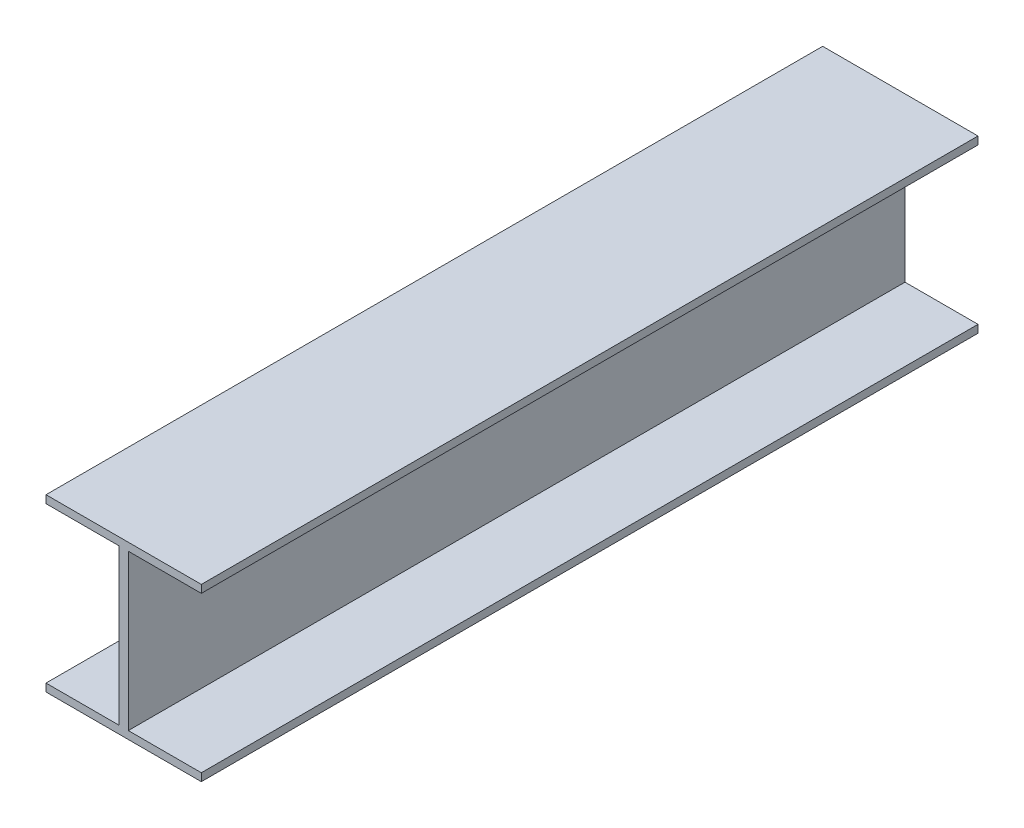
ISO-10303-21;
HEADER;
FILE_DESCRIPTION(('STEP AP214'),'2;1');
FILE_NAME('part.step','',(''),(''),'','','');
FILE_SCHEMA(('AUTOMOTIVE_DESIGN { 1 0 10303 214 1 1 1 1 }'));
ENDSEC;
DATA;
#1=APPLICATION_CONTEXT('core data for automotive mechanical design processes');
#2=APPLICATION_PROTOCOL_DEFINITION('international standard','automotive_design',2000,#1);
#3=PRODUCT_CONTEXT('',#1,'mechanical');
#4=PRODUCT('Part','Part','',(#3));
#5=PRODUCT_RELATED_PRODUCT_CATEGORY('part','',(#4));
#6=PRODUCT_DEFINITION_FORMATION('','',#4);
#7=PRODUCT_DEFINITION_CONTEXT('part definition',#1,'design');
#8=PRODUCT_DEFINITION('design','',#6,#7);
#9=PRODUCT_DEFINITION_SHAPE('','',#8);
#10=(LENGTH_UNIT() NAMED_UNIT(*) SI_UNIT(.MILLI.,.METRE.));
#11=(NAMED_UNIT(*) PLANE_ANGLE_UNIT() SI_UNIT($,.RADIAN.));
#12=(NAMED_UNIT(*) SI_UNIT($,.STERADIAN.) SOLID_ANGLE_UNIT());
#13=UNCERTAINTY_MEASURE_WITH_UNIT(LENGTH_MEASURE(1.E-05),#10,'distance_accuracy_value','');
#14=(GEOMETRIC_REPRESENTATION_CONTEXT(3) GLOBAL_UNCERTAINTY_ASSIGNED_CONTEXT((#13)) GLOBAL_UNIT_ASSIGNED_CONTEXT((#10,
#11,#12)) REPRESENTATION_CONTEXT('',''));
#15=CARTESIAN_POINT('',(0.,0.,0.));
#16=DIRECTION('',(0.,0.,1.));
#17=DIRECTION('',(1.,0.,0.));
#18=AXIS2_PLACEMENT_3D('',#15,#16,#17);
#19=CARTESIAN_POINT('',(-50.,-50.,500.));
#20=DIRECTION('',(0.,-1.,0.));
#21=DIRECTION('',(0.,0.,-1.));
#22=AXIS2_PLACEMENT_3D('',#19,#20,#21);
#23=PLANE('',#22);
#24=DIRECTION('',(-1.,0.,0.));
#25=VECTOR('',#24,1.);
#26=CARTESIAN_POINT('',(-50.,-50.,0.));
#27=LINE('',#26,#25);
#28=CARTESIAN_POINT('',(-3.,-50.,0.));
#29=VERTEX_POINT('',#28);
#30=CARTESIAN_POINT('',(-50.,-50.,0.));
#31=VERTEX_POINT('',#30);
#32=EDGE_CURVE('E158',#29,#31,#27,.T.);
#33=ORIENTED_EDGE('',*,*,#32,.T.);
#34=DIRECTION('',(0.,0.,-1.));
#35=VECTOR('',#34,1.);
#36=CARTESIAN_POINT('',(-50.,-50.,500.));
#37=LINE('',#36,#35);
#38=CARTESIAN_POINT('',(-50.,-50.,500.));
#39=VERTEX_POINT('',#38);
#40=EDGE_CURVE('E11',#39,#31,#37,.T.);
#41=ORIENTED_EDGE('',*,*,#40,.F.);
#42=DIRECTION('',(-1.,0.,0.));
#43=VECTOR('',#42,1.);
#44=CARTESIAN_POINT('',(-50.,-50.,500.));
#45=LINE('',#44,#43);
#46=CARTESIAN_POINT('',(-3.,-50.,500.));
#47=VERTEX_POINT('',#46);
#48=EDGE_CURVE('E180',#47,#39,#45,.T.);
#49=ORIENTED_EDGE('',*,*,#48,.F.);
#50=DIRECTION('',(0.,0.,-1.));
#51=VECTOR('',#50,1.);
#52=CARTESIAN_POINT('',(-3.,-50.,500.));
#53=LINE('',#52,#51);
#54=EDGE_CURVE('E154',#47,#29,#53,.T.);
#55=ORIENTED_EDGE('',*,*,#54,.T.);
#56=EDGE_LOOP('',(#33,#41,#49,#55));
#57=FACE_BOUND('',#56,.T.);
#58=ADVANCED_FACE('F38',(#57),#23,.F.);
#59=CARTESIAN_POINT('',(-50.,-50.,500.));
#60=DIRECTION('',(1.,0.,0.));
#61=DIRECTION('',(0.,0.,-1.));
#62=AXIS2_PLACEMENT_3D('',#59,#60,#61);
#63=PLANE('',#62);
#64=DIRECTION('',(0.,-1.,0.));
#65=VECTOR('',#64,1.);
#66=CARTESIAN_POINT('',(-50.,-50.,0.));
#67=LINE('',#66,#65);
#68=CARTESIAN_POINT('',(-50.,-55.,0.));
#69=VERTEX_POINT('',#68);
#70=EDGE_CURVE('E161',#31,#69,#67,.T.);
#71=ORIENTED_EDGE('',*,*,#70,.T.);
#72=DIRECTION('',(0.,0.,-1.));
#73=VECTOR('',#72,1.);
#74=CARTESIAN_POINT('',(-50.,-55.,500.));
#75=LINE('',#74,#73);
#76=CARTESIAN_POINT('',(-50.,-55.,500.));
#77=VERTEX_POINT('',#76);
#78=EDGE_CURVE('E46',#77,#69,#75,.T.);
#79=ORIENTED_EDGE('',*,*,#78,.F.);
#80=DIRECTION('',(0.,-1.,0.));
#81=VECTOR('',#80,1.);
#82=CARTESIAN_POINT('',(-50.,-50.,500.));
#83=LINE('',#82,#81);
#84=EDGE_CURVE('E109',#39,#77,#83,.T.);
#85=ORIENTED_EDGE('',*,*,#84,.F.);
#86=ORIENTED_EDGE('',*,*,#40,.T.);
#87=EDGE_LOOP('',(#71,#79,#85,#86));
#88=FACE_BOUND('',#87,.T.);
#89=ADVANCED_FACE('F258',(#88),#63,.F.);
#90=CARTESIAN_POINT('',(-50.,-55.,500.));
#91=DIRECTION('',(0.,1.,0.));
#92=DIRECTION('',(-1.,0.,0.));
#93=AXIS2_PLACEMENT_3D('',#90,#91,#92);
#94=PLANE('',#93);
#95=DIRECTION('',(1.,0.,0.));
#96=VECTOR('',#95,1.);
#97=CARTESIAN_POINT('',(-50.,-55.,0.));
#98=LINE('',#97,#96);
#99=CARTESIAN_POINT('',(50.,-55.,0.));
#100=VERTEX_POINT('',#99);
#101=EDGE_CURVE('E163',#69,#100,#98,.T.);
#102=ORIENTED_EDGE('',*,*,#101,.T.);
#103=DIRECTION('',(0.,0.,-1.));
#104=VECTOR('',#103,1.);
#105=CARTESIAN_POINT('',(50.,-55.,500.));
#106=LINE('',#105,#104);
#107=CARTESIAN_POINT('',(50.,-55.,500.));
#108=VERTEX_POINT('',#107);
#109=EDGE_CURVE('E199',#108,#100,#106,.T.);
#110=ORIENTED_EDGE('',*,*,#109,.F.);
#111=DIRECTION('',(1.,0.,0.));
#112=VECTOR('',#111,1.);
#113=CARTESIAN_POINT('',(-50.,-55.,500.));
#114=LINE('',#113,#112);
#115=EDGE_CURVE('E207',#77,#108,#114,.T.);
#116=ORIENTED_EDGE('',*,*,#115,.F.);
#117=ORIENTED_EDGE('',*,*,#78,.T.);
#118=EDGE_LOOP('',(#102,#110,#116,#117));
#119=FACE_BOUND('',#118,.T.);
#120=ADVANCED_FACE('F205',(#119),#94,.F.);
#121=CARTESIAN_POINT('',(50.,-50.,500.));
#122=DIRECTION('',(-1.,0.,0.));
#123=DIRECTION('',(0.,0.,1.));
#124=AXIS2_PLACEMENT_3D('',#121,#122,#123);
#125=PLANE('',#124);
#126=DIRECTION('',(0.,1.,0.));
#127=VECTOR('',#126,1.);
#128=CARTESIAN_POINT('',(50.,-50.,0.));
#129=LINE('',#128,#127);
#130=CARTESIAN_POINT('',(50.,-50.,0.));
#131=VERTEX_POINT('',#130);
#132=EDGE_CURVE('E165',#100,#131,#129,.T.);
#133=ORIENTED_EDGE('',*,*,#132,.T.);
#134=DIRECTION('',(0.,0.,-1.));
#135=VECTOR('',#134,1.);
#136=CARTESIAN_POINT('',(50.,-50.,500.));
#137=LINE('',#136,#135);
#138=CARTESIAN_POINT('',(50.,-50.,500.));
#139=VERTEX_POINT('',#138);
#140=EDGE_CURVE('E196',#139,#131,#137,.T.);
#141=ORIENTED_EDGE('',*,*,#140,.F.);
#142=DIRECTION('',(0.,1.,0.));
#143=VECTOR('',#142,1.);
#144=CARTESIAN_POINT('',(50.,-50.,500.));
#145=LINE('',#144,#143);
#146=EDGE_CURVE('E225',#108,#139,#145,.T.);
#147=ORIENTED_EDGE('',*,*,#146,.F.);
#148=ORIENTED_EDGE('',*,*,#109,.T.);
#149=EDGE_LOOP('',(#133,#141,#147,#148));
#150=FACE_BOUND('',#149,.T.);
#151=ADVANCED_FACE('F216',(#150),#125,.F.);
#152=CARTESIAN_POINT('',(3.,-50.,500.));
#153=DIRECTION('',(0.,-1.,0.));
#154=DIRECTION('',(0.,0.,-1.));
#155=AXIS2_PLACEMENT_3D('',#152,#153,#154);
#156=PLANE('',#155);
#157=DIRECTION('',(-1.,0.,0.));
#158=VECTOR('',#157,1.);
#159=CARTESIAN_POINT('',(3.,-50.,0.));
#160=LINE('',#159,#158);
#161=CARTESIAN_POINT('',(3.,-50.,0.));
#162=VERTEX_POINT('',#161);
#163=EDGE_CURVE('E167',#131,#162,#160,.T.);
#164=ORIENTED_EDGE('',*,*,#163,.T.);
#165=DIRECTION('',(0.,0.,-1.));
#166=VECTOR('',#165,1.);
#167=CARTESIAN_POINT('',(3.,-50.,500.));
#168=LINE('',#167,#166);
#169=CARTESIAN_POINT('',(3.,-50.,500.));
#170=VERTEX_POINT('',#169);
#171=EDGE_CURVE('E193',#170,#162,#168,.T.);
#172=ORIENTED_EDGE('',*,*,#171,.F.);
#173=DIRECTION('',(-1.,0.,0.));
#174=VECTOR('',#173,1.);
#175=CARTESIAN_POINT('',(3.,-50.,500.));
#176=LINE('',#175,#174);
#177=EDGE_CURVE('E222',#139,#170,#176,.T.);
#178=ORIENTED_EDGE('',*,*,#177,.F.);
#179=ORIENTED_EDGE('',*,*,#140,.T.);
#180=EDGE_LOOP('',(#164,#172,#178,#179));
#181=FACE_BOUND('',#180,.T.);
#182=ADVANCED_FACE('F220',(#181),#156,.F.);
#183=CARTESIAN_POINT('',(3.,-50.,500.));
#184=DIRECTION('',(-1.,0.,0.));
#185=DIRECTION('',(0.,0.,1.));
#186=AXIS2_PLACEMENT_3D('',#183,#184,#185);
#187=PLANE('',#186);
#188=DIRECTION('',(0.,1.,0.));
#189=VECTOR('',#188,1.);
#190=CARTESIAN_POINT('',(3.,-50.,0.));
#191=LINE('',#190,#189);
#192=CARTESIAN_POINT('',(3.,50.,0.));
#193=VERTEX_POINT('',#192);
#194=EDGE_CURVE('E169',#162,#193,#191,.T.);
#195=ORIENTED_EDGE('',*,*,#194,.T.);
#196=DIRECTION('',(0.,0.,-1.));
#197=VECTOR('',#196,1.);
#198=CARTESIAN_POINT('',(3.,50.,500.));
#199=LINE('',#198,#197);
#200=CARTESIAN_POINT('',(3.,50.,500.));
#201=VERTEX_POINT('',#200);
#202=EDGE_CURVE('E190',#201,#193,#199,.T.);
#203=ORIENTED_EDGE('',*,*,#202,.F.);
#204=DIRECTION('',(0.,1.,0.));
#205=VECTOR('',#204,1.);
#206=CARTESIAN_POINT('',(3.,-50.,500.));
#207=LINE('',#206,#205);
#208=EDGE_CURVE('E224',#170,#201,#207,.T.);
#209=ORIENTED_EDGE('',*,*,#208,.F.);
#210=ORIENTED_EDGE('',*,*,#171,.T.);
#211=EDGE_LOOP('',(#195,#203,#209,#210));
#212=FACE_BOUND('',#211,.T.);
#213=ADVANCED_FACE('F271',(#212),#187,.F.);
#214=CARTESIAN_POINT('',(3.,50.,500.));
#215=DIRECTION('',(0.,1.,0.));
#216=DIRECTION('',(0.,0.,1.));
#217=AXIS2_PLACEMENT_3D('',#214,#215,#216);
#218=PLANE('',#217);
#219=DIRECTION('',(1.,0.,0.));
#220=VECTOR('',#219,1.);
#221=CARTESIAN_POINT('',(3.,50.,0.));
#222=LINE('',#221,#220);
#223=CARTESIAN_POINT('',(50.,50.,0.));
#224=VERTEX_POINT('',#223);
#225=EDGE_CURVE('E171',#193,#224,#222,.T.);
#226=ORIENTED_EDGE('',*,*,#225,.T.);
#227=DIRECTION('',(0.,0.,-1.));
#228=VECTOR('',#227,1.);
#229=CARTESIAN_POINT('',(50.,50.,500.));
#230=LINE('',#229,#228);
#231=CARTESIAN_POINT('',(50.,50.,500.));
#232=VERTEX_POINT('',#231);
#233=EDGE_CURVE('E187',#232,#224,#230,.T.);
#234=ORIENTED_EDGE('',*,*,#233,.F.);
#235=DIRECTION('',(1.,0.,0.));
#236=VECTOR('',#235,1.);
#237=CARTESIAN_POINT('',(3.,50.,500.));
#238=LINE('',#237,#236);
#239=EDGE_CURVE('E227',#201,#232,#238,.T.);
#240=ORIENTED_EDGE('',*,*,#239,.F.);
#241=ORIENTED_EDGE('',*,*,#202,.T.);
#242=EDGE_LOOP('',(#226,#234,#240,#241));
#243=FACE_BOUND('',#242,.T.);
#244=ADVANCED_FACE('F274',(#243),#218,.F.);
#245=CARTESIAN_POINT('',(50.,50.,500.));
#246=DIRECTION('',(-1.,0.,0.));
#247=DIRECTION('',(0.,0.,1.));
#248=AXIS2_PLACEMENT_3D('',#245,#246,#247);
#249=PLANE('',#248);
#250=DIRECTION('',(0.,1.,0.));
#251=VECTOR('',#250,1.);
#252=CARTESIAN_POINT('',(50.,50.,0.));
#253=LINE('',#252,#251);
#254=CARTESIAN_POINT('',(50.,55.,0.));
#255=VERTEX_POINT('',#254);
#256=EDGE_CURVE('E173',#224,#255,#253,.T.);
#257=ORIENTED_EDGE('',*,*,#256,.T.);
#258=DIRECTION('',(0.,0.,-1.));
#259=VECTOR('',#258,1.);
#260=CARTESIAN_POINT('',(50.,55.,500.));
#261=LINE('',#260,#259);
#262=CARTESIAN_POINT('',(50.,55.,500.));
#263=VERTEX_POINT('',#262);
#264=EDGE_CURVE('E184',#263,#255,#261,.T.);
#265=ORIENTED_EDGE('',*,*,#264,.F.);
#266=DIRECTION('',(0.,1.,0.));
#267=VECTOR('',#266,1.);
#268=CARTESIAN_POINT('',(50.,50.,500.));
#269=LINE('',#268,#267);
#270=EDGE_CURVE('E233',#232,#263,#269,.T.);
#271=ORIENTED_EDGE('',*,*,#270,.F.);
#272=ORIENTED_EDGE('',*,*,#233,.T.);
#273=EDGE_LOOP('',(#257,#265,#271,#272));
#274=FACE_BOUND('',#273,.T.);
#275=ADVANCED_FACE('F239',(#274),#249,.F.);
#276=CARTESIAN_POINT('',(-50.,55.,500.));
#277=DIRECTION('',(0.,-1.,0.));
#278=DIRECTION('',(1.,0.,0.));
#279=AXIS2_PLACEMENT_3D('',#276,#277,#278);
#280=PLANE('',#279);
#281=DIRECTION('',(-1.,0.,0.));
#282=VECTOR('',#281,1.);
#283=CARTESIAN_POINT('',(-50.,55.,0.));
#284=LINE('',#283,#282);
#285=CARTESIAN_POINT('',(-50.,55.,0.));
#286=VERTEX_POINT('',#285);
#287=EDGE_CURVE('E175',#255,#286,#284,.T.);
#288=ORIENTED_EDGE('',*,*,#287,.T.);
#289=DIRECTION('',(0.,0.,-1.));
#290=VECTOR('',#289,1.);
#291=CARTESIAN_POINT('',(-50.,55.,500.));
#292=LINE('',#291,#290);
#293=CARTESIAN_POINT('',(-50.,55.,500.));
#294=VERTEX_POINT('',#293);
#295=EDGE_CURVE('E149',#294,#286,#292,.T.);
#296=ORIENTED_EDGE('',*,*,#295,.F.);
#297=DIRECTION('',(-1.,0.,0.));
#298=VECTOR('',#297,1.);
#299=CARTESIAN_POINT('',(-50.,55.,500.));
#300=LINE('',#299,#298);
#301=EDGE_CURVE('E140',#263,#294,#300,.T.);
#302=ORIENTED_EDGE('',*,*,#301,.F.);
#303=ORIENTED_EDGE('',*,*,#264,.T.);
#304=EDGE_LOOP('',(#288,#296,#302,#303));
#305=FACE_BOUND('',#304,.T.);
#306=ADVANCED_FACE('F243',(#305),#280,.F.);
#307=CARTESIAN_POINT('',(-50.,50.,500.));
#308=DIRECTION('',(1.,0.,0.));
#309=DIRECTION('',(0.,0.,-1.));
#310=AXIS2_PLACEMENT_3D('',#307,#308,#309);
#311=PLANE('',#310);
#312=DIRECTION('',(0.,-1.,0.));
#313=VECTOR('',#312,1.);
#314=CARTESIAN_POINT('',(-50.,50.,0.));
#315=LINE('',#314,#313);
#316=CARTESIAN_POINT('',(-50.,50.,0.));
#317=VERTEX_POINT('',#316);
#318=EDGE_CURVE('E148',#286,#317,#315,.T.);
#319=ORIENTED_EDGE('',*,*,#318,.T.);
#320=DIRECTION('',(0.,0.,-1.));
#321=VECTOR('',#320,1.);
#322=CARTESIAN_POINT('',(-50.,50.,500.));
#323=LINE('',#322,#321);
#324=CARTESIAN_POINT('',(-50.,50.,500.));
#325=VERTEX_POINT('',#324);
#326=EDGE_CURVE('E145',#325,#317,#323,.T.);
#327=ORIENTED_EDGE('',*,*,#326,.F.);
#328=DIRECTION('',(0.,-1.,0.));
#329=VECTOR('',#328,1.);
#330=CARTESIAN_POINT('',(-50.,50.,500.));
#331=LINE('',#330,#329);
#332=EDGE_CURVE('E134',#294,#325,#331,.T.);
#333=ORIENTED_EDGE('',*,*,#332,.F.);
#334=ORIENTED_EDGE('',*,*,#295,.T.);
#335=EDGE_LOOP('',(#319,#327,#333,#334));
#336=FACE_BOUND('',#335,.T.);
#337=ADVANCED_FACE('F146',(#336),#311,.F.);
#338=CARTESIAN_POINT('',(-50.,50.,500.));
#339=DIRECTION('',(0.,1.,0.));
#340=DIRECTION('',(0.,0.,1.));
#341=AXIS2_PLACEMENT_3D('',#338,#339,#340);
#342=PLANE('',#341);
#343=DIRECTION('',(1.,0.,0.));
#344=VECTOR('',#343,1.);
#345=CARTESIAN_POINT('',(-50.,50.,0.));
#346=LINE('',#345,#344);
#347=CARTESIAN_POINT('',(-3.,50.,0.));
#348=VERTEX_POINT('',#347);
#349=EDGE_CURVE('E95',#317,#348,#346,.T.);
#350=ORIENTED_EDGE('',*,*,#349,.T.);
#351=DIRECTION('',(0.,0.,-1.));
#352=VECTOR('',#351,1.);
#353=CARTESIAN_POINT('',(-3.,50.,500.));
#354=LINE('',#353,#352);
#355=CARTESIAN_POINT('',(-3.,50.,500.));
#356=VERTEX_POINT('',#355);
#357=EDGE_CURVE('E150',#356,#348,#354,.T.);
#358=ORIENTED_EDGE('',*,*,#357,.F.);
#359=DIRECTION('',(1.,0.,0.));
#360=VECTOR('',#359,1.);
#361=CARTESIAN_POINT('',(-50.,50.,500.));
#362=LINE('',#361,#360);
#363=EDGE_CURVE('E138',#325,#356,#362,.T.);
#364=ORIENTED_EDGE('',*,*,#363,.F.);
#365=ORIENTED_EDGE('',*,*,#326,.T.);
#366=EDGE_LOOP('',(#350,#358,#364,#365));
#367=FACE_BOUND('',#366,.T.);
#368=ADVANCED_FACE('F152',(#367),#342,.F.);
#369=CARTESIAN_POINT('',(-3.,-50.,500.));
#370=DIRECTION('',(1.,0.,0.));
#371=DIRECTION('',(0.,0.,-1.));
#372=AXIS2_PLACEMENT_3D('',#369,#370,#371);
#373=PLANE('',#372);
#374=DIRECTION('',(0.,-1.,0.));
#375=VECTOR('',#374,1.);
#376=CARTESIAN_POINT('',(-3.,-50.,0.));
#377=LINE('',#376,#375);
#378=EDGE_CURVE('E101',#348,#29,#377,.T.);
#379=ORIENTED_EDGE('',*,*,#378,.T.);
#380=ORIENTED_EDGE('',*,*,#54,.F.);
#381=DIRECTION('',(0.,-1.,0.));
#382=VECTOR('',#381,1.);
#383=CARTESIAN_POINT('',(-3.,-50.,500.));
#384=LINE('',#383,#382);
#385=EDGE_CURVE('E54',#356,#47,#384,.T.);
#386=ORIENTED_EDGE('',*,*,#385,.F.);
#387=ORIENTED_EDGE('',*,*,#357,.T.);
#388=EDGE_LOOP('',(#379,#380,#386,#387));
#389=FACE_BOUND('',#388,.T.);
#390=ADVANCED_FACE('F247',(#389),#373,.F.);
#391=CARTESIAN_POINT('',(0.,0.,500.));
#392=DIRECTION('',(0.,0.,1.));
#393=DIRECTION('',(1.,0.,0.));
#394=AXIS2_PLACEMENT_3D('',#391,#392,#393);
#395=PLANE('',#394);
#396=ORIENTED_EDGE('',*,*,#48,.T.);
#397=ORIENTED_EDGE('',*,*,#84,.T.);
#398=ORIENTED_EDGE('',*,*,#115,.T.);
#399=ORIENTED_EDGE('',*,*,#146,.T.);
#400=ORIENTED_EDGE('',*,*,#177,.T.);
#401=ORIENTED_EDGE('',*,*,#208,.T.);
#402=ORIENTED_EDGE('',*,*,#239,.T.);
#403=ORIENTED_EDGE('',*,*,#270,.T.);
#404=ORIENTED_EDGE('',*,*,#301,.T.);
#405=ORIENTED_EDGE('',*,*,#332,.T.);
#406=ORIENTED_EDGE('',*,*,#363,.T.);
#407=ORIENTED_EDGE('',*,*,#385,.T.);
#408=EDGE_LOOP('',(#396,#397,#398,#399,#400,#401,#402,#403,#404,#405,#406,#407));
#409=FACE_BOUND('',#408,.T.);
#410=ADVANCED_FACE('F136',(#409),#395,.T.);
#411=CARTESIAN_POINT('',(0.,0.,0.));
#412=DIRECTION('',(0.,0.,1.));
#413=DIRECTION('',(1.,0.,0.));
#414=AXIS2_PLACEMENT_3D('',#411,#412,#413);
#415=PLANE('',#414);
#416=ORIENTED_EDGE('',*,*,#32,.F.);
#417=ORIENTED_EDGE('',*,*,#378,.F.);
#418=ORIENTED_EDGE('',*,*,#349,.F.);
#419=ORIENTED_EDGE('',*,*,#318,.F.);
#420=ORIENTED_EDGE('',*,*,#287,.F.);
#421=ORIENTED_EDGE('',*,*,#256,.F.);
#422=ORIENTED_EDGE('',*,*,#225,.F.);
#423=ORIENTED_EDGE('',*,*,#194,.F.);
#424=ORIENTED_EDGE('',*,*,#163,.F.);
#425=ORIENTED_EDGE('',*,*,#132,.F.);
#426=ORIENTED_EDGE('',*,*,#101,.F.);
#427=ORIENTED_EDGE('',*,*,#70,.F.);
#428=EDGE_LOOP('',(#416,#417,#418,#419,#420,#421,#422,#423,#424,#425,#426,#427));
#429=FACE_BOUND('',#428,.T.);
#430=ADVANCED_FACE('F211',(#429),#415,.F.);
#431=CLOSED_SHELL('',(#58,#89,#120,#151,#182,#213,#244,#275,#306,#337,#368,#390,#410,#430));
#432=MANIFOLD_SOLID_BREP('B2',#431);
#433=ADVANCED_BREP_SHAPE_REPRESENTATION('',(#18,#432),#14);
#434=SHAPE_DEFINITION_REPRESENTATION(#9,#433);
ENDSEC;
END-ISO-10303-21;
